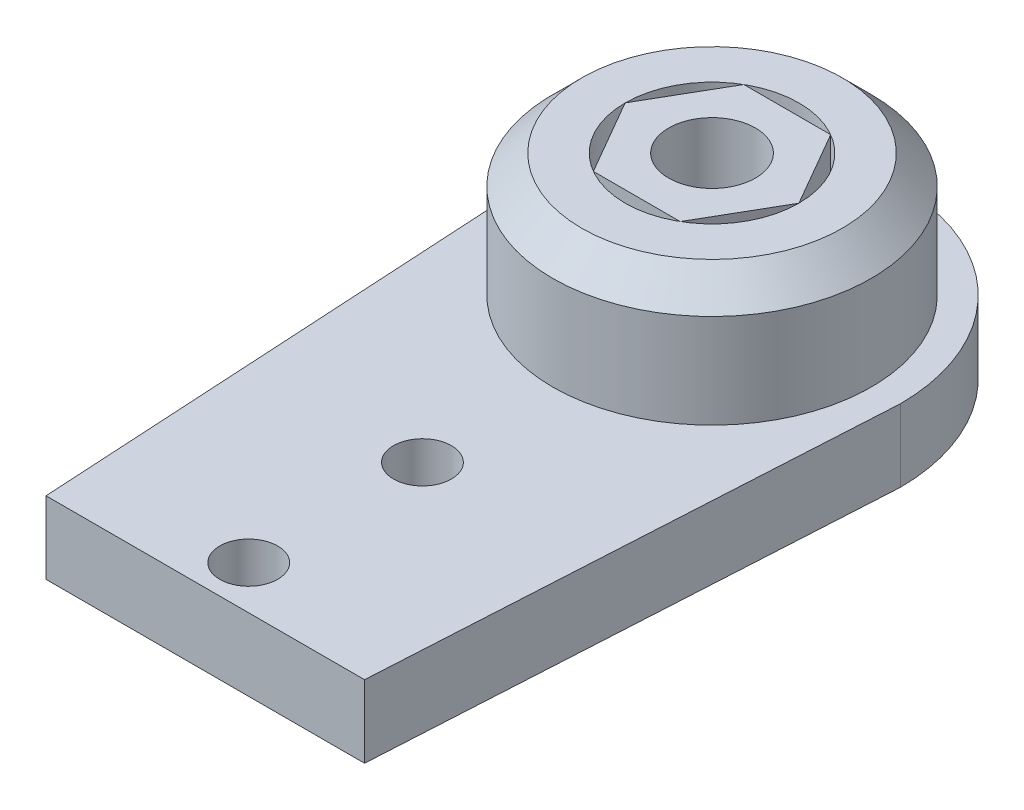
ISO-10303-21;
HEADER;
FILE_DESCRIPTION(('STEP AP214'),'2;1');
FILE_NAME('part.step','',(''),(''),'','','');
FILE_SCHEMA(('AUTOMOTIVE_DESIGN { 1 0 10303 214 1 1 1 1 }'));
ENDSEC;
DATA;
#1=APPLICATION_CONTEXT('core data for automotive mechanical design processes');
#2=APPLICATION_PROTOCOL_DEFINITION('international standard','automotive_design',2000,#1);
#3=PRODUCT_CONTEXT('',#1,'mechanical');
#4=PRODUCT('Part','Part','',(#3));
#5=PRODUCT_RELATED_PRODUCT_CATEGORY('part','',(#4));
#6=PRODUCT_DEFINITION_FORMATION('','',#4);
#7=PRODUCT_DEFINITION_CONTEXT('part definition',#1,'design');
#8=PRODUCT_DEFINITION('design','',#6,#7);
#9=PRODUCT_DEFINITION_SHAPE('','',#8);
#10=(LENGTH_UNIT() NAMED_UNIT(*) SI_UNIT(.MILLI.,.METRE.));
#11=(NAMED_UNIT(*) PLANE_ANGLE_UNIT() SI_UNIT($,.RADIAN.));
#12=(NAMED_UNIT(*) SI_UNIT($,.STERADIAN.) SOLID_ANGLE_UNIT());
#13=UNCERTAINTY_MEASURE_WITH_UNIT(LENGTH_MEASURE(1.E-05),#10,'distance_accuracy_value','');
#14=(GEOMETRIC_REPRESENTATION_CONTEXT(3) GLOBAL_UNCERTAINTY_ASSIGNED_CONTEXT((#13)) GLOBAL_UNIT_ASSIGNED_CONTEXT((#10,
#11,#12)) REPRESENTATION_CONTEXT('',''));
#15=CARTESIAN_POINT('',(0.,0.,0.));
#16=DIRECTION('',(0.,0.,1.));
#17=DIRECTION('',(1.,0.,0.));
#18=AXIS2_PLACEMENT_3D('',#15,#16,#17);
#19=CARTESIAN_POINT('',(1.50000000000003,4.25,2.5980762113533));
#20=DIRECTION('',(0.866025403784442,0.,0.499999999999995));
#21=DIRECTION('',(0.499999999999995,0.,-0.866025403784442));
#22=AXIS2_PLACEMENT_3D('',#19,#20,#21);
#23=PLANE('',#22);
#24=DIRECTION('',(0.499999999999995,0.,-0.866025403784441));
#25=VECTOR('',#24,1.);
#26=CARTESIAN_POINT('',(1.50000000000003,6.75,2.5980762113533));
#27=LINE('',#26,#25);
#28=CARTESIAN_POINT('',(1.50000000000003,6.75,2.5980762113533));
#29=VERTEX_POINT('',#28);
#30=CARTESIAN_POINT('',(3.,6.75,0.));
#31=VERTEX_POINT('',#30);
#32=EDGE_CURVE('E129',#29,#31,#27,.T.);
#33=ORIENTED_EDGE('',*,*,#32,.F.);
#34=DIRECTION('',(0.,1.,0.));
#35=VECTOR('',#34,1.);
#36=CARTESIAN_POINT('',(1.50000000000003,4.25,2.5980762113533));
#37=LINE('',#36,#35);
#38=CARTESIAN_POINT('',(1.50000000000003,4.25,2.5980762113533));
#39=VERTEX_POINT('',#38);
#40=EDGE_CURVE('E12',#39,#29,#37,.T.);
#41=ORIENTED_EDGE('',*,*,#40,.F.);
#42=DIRECTION('',(0.499999999999995,0.,-0.866025403784441));
#43=VECTOR('',#42,1.);
#44=CARTESIAN_POINT('',(1.50000000000003,4.25,2.5980762113533));
#45=LINE('',#44,#43);
#46=CARTESIAN_POINT('',(3.,4.25,0.));
#47=VERTEX_POINT('',#46);
#48=EDGE_CURVE('E144',#39,#47,#45,.T.);
#49=ORIENTED_EDGE('',*,*,#48,.T.);
#50=DIRECTION('',(0.,1.,0.));
#51=VECTOR('',#50,1.);
#52=CARTESIAN_POINT('',(3.,4.25,0.));
#53=LINE('',#52,#51);
#54=EDGE_CURVE('E47',#47,#31,#53,.T.);
#55=ORIENTED_EDGE('',*,*,#54,.T.);
#56=EDGE_LOOP('',(#33,#41,#49,#55));
#57=FACE_BOUND('',#56,.T.);
#58=ADVANCED_FACE('F44',(#57),#23,.T.);
#59=CARTESIAN_POINT('',(-1.49999999999998,4.25,2.59807621135333));
#60=DIRECTION('',(0.,0.,1.));
#61=DIRECTION('',(1.,0.,0.));
#62=AXIS2_PLACEMENT_3D('',#59,#60,#61);
#63=PLANE('',#62);
#64=DIRECTION('',(1.,0.,0.));
#65=VECTOR('',#64,1.);
#66=CARTESIAN_POINT('',(-1.49999999999998,6.75,2.59807621135333));
#67=LINE('',#66,#65);
#68=CARTESIAN_POINT('',(-1.49999999999998,6.75,2.59807621135333));
#69=VERTEX_POINT('',#68);
#70=EDGE_CURVE('E142',#69,#29,#67,.T.);
#71=ORIENTED_EDGE('',*,*,#70,.F.);
#72=DIRECTION('',(0.,1.,0.));
#73=VECTOR('',#72,1.);
#74=CARTESIAN_POINT('',(-1.49999999999998,4.25,2.59807621135333));
#75=LINE('',#74,#73);
#76=CARTESIAN_POINT('',(-1.49999999999998,4.25,2.59807621135333));
#77=VERTEX_POINT('',#76);
#78=EDGE_CURVE('E53',#77,#69,#75,.T.);
#79=ORIENTED_EDGE('',*,*,#78,.F.);
#80=DIRECTION('',(1.,0.,0.));
#81=VECTOR('',#80,1.);
#82=CARTESIAN_POINT('',(-1.49999999999998,4.25,2.59807621135333));
#83=LINE('',#82,#81);
#84=EDGE_CURVE('E119',#77,#39,#83,.T.);
#85=ORIENTED_EDGE('',*,*,#84,.T.);
#86=ORIENTED_EDGE('',*,*,#40,.T.);
#87=EDGE_LOOP('',(#71,#79,#85,#86));
#88=FACE_BOUND('',#87,.T.);
#89=ADVANCED_FACE('F152',(#88),#63,.T.);
#90=CARTESIAN_POINT('',(-3.,4.25,0.));
#91=DIRECTION('',(-0.866025403784435,0.,0.500000000000007));
#92=DIRECTION('',(0.500000000000007,0.,0.866025403784435));
#93=AXIS2_PLACEMENT_3D('',#90,#91,#92);
#94=PLANE('',#93);
#95=DIRECTION('',(0.500000000000007,0.,0.866025403784434));
#96=VECTOR('',#95,1.);
#97=CARTESIAN_POINT('',(-3.,6.75,0.));
#98=LINE('',#97,#96);
#99=CARTESIAN_POINT('',(-3.,6.75,0.));
#100=VERTEX_POINT('',#99);
#101=EDGE_CURVE('E106',#100,#69,#98,.T.);
#102=ORIENTED_EDGE('',*,*,#101,.F.);
#103=DIRECTION('',(0.,1.,0.));
#104=VECTOR('',#103,1.);
#105=CARTESIAN_POINT('',(-3.,4.25,0.));
#106=LINE('',#105,#104);
#107=CARTESIAN_POINT('',(-3.,4.25,0.));
#108=VERTEX_POINT('',#107);
#109=EDGE_CURVE('E101',#108,#100,#106,.T.);
#110=ORIENTED_EDGE('',*,*,#109,.F.);
#111=DIRECTION('',(0.500000000000007,0.,0.866025403784434));
#112=VECTOR('',#111,1.);
#113=CARTESIAN_POINT('',(-3.,4.25,0.));
#114=LINE('',#113,#112);
#115=EDGE_CURVE('E104',#108,#77,#114,.T.);
#116=ORIENTED_EDGE('',*,*,#115,.T.);
#117=ORIENTED_EDGE('',*,*,#78,.T.);
#118=EDGE_LOOP('',(#102,#110,#116,#117));
#119=FACE_BOUND('',#118,.T.);
#120=ADVANCED_FACE('F103',(#119),#94,.T.);
#121=CARTESIAN_POINT('',(-1.50000000000001,4.25,-2.59807621135331));
#122=DIRECTION('',(-0.866025403784442,0.,-0.499999999999995));
#123=DIRECTION('',(-0.499999999999995,0.,0.866025403784442));
#124=AXIS2_PLACEMENT_3D('',#121,#122,#123);
#125=PLANE('',#124);
#126=DIRECTION('',(-0.499999999999995,0.,0.866025403784441));
#127=VECTOR('',#126,1.);
#128=CARTESIAN_POINT('',(-1.50000000000001,6.75,-2.59807621135331));
#129=LINE('',#128,#127);
#130=CARTESIAN_POINT('',(-1.50000000000001,6.75,-2.59807621135331));
#131=VERTEX_POINT('',#130);
#132=EDGE_CURVE('E139',#131,#100,#129,.T.);
#133=ORIENTED_EDGE('',*,*,#132,.F.);
#134=DIRECTION('',(0.,1.,0.));
#135=VECTOR('',#134,1.);
#136=CARTESIAN_POINT('',(-1.50000000000001,4.25,-2.59807621135331));
#137=LINE('',#136,#135);
#138=CARTESIAN_POINT('',(-1.50000000000001,4.25,-2.59807621135331));
#139=VERTEX_POINT('',#138);
#140=EDGE_CURVE('E111',#139,#131,#137,.T.);
#141=ORIENTED_EDGE('',*,*,#140,.F.);
#142=DIRECTION('',(-0.499999999999995,0.,0.866025403784441));
#143=VECTOR('',#142,1.);
#144=CARTESIAN_POINT('',(-1.50000000000001,4.25,-2.59807621135331));
#145=LINE('',#144,#143);
#146=EDGE_CURVE('E117',#139,#108,#145,.T.);
#147=ORIENTED_EDGE('',*,*,#146,.T.);
#148=ORIENTED_EDGE('',*,*,#109,.T.);
#149=EDGE_LOOP('',(#133,#141,#147,#148));
#150=FACE_BOUND('',#149,.T.);
#151=ADVANCED_FACE('F121',(#150),#125,.T.);
#152=CARTESIAN_POINT('',(1.49999999999999,4.25,-2.59807621135332));
#153=DIRECTION('',(0.,0.,-1.));
#154=DIRECTION('',(-1.,0.,0.));
#155=AXIS2_PLACEMENT_3D('',#152,#153,#154);
#156=PLANE('',#155);
#157=DIRECTION('',(-1.,0.,0.));
#158=VECTOR('',#157,1.);
#159=CARTESIAN_POINT('',(1.49999999999999,6.75,-2.59807621135332));
#160=LINE('',#159,#158);
#161=CARTESIAN_POINT('',(1.49999999999999,6.75,-2.59807621135332));
#162=VERTEX_POINT('',#161);
#163=EDGE_CURVE('E136',#162,#131,#160,.T.);
#164=ORIENTED_EDGE('',*,*,#163,.F.);
#165=DIRECTION('',(0.,1.,0.));
#166=VECTOR('',#165,1.);
#167=CARTESIAN_POINT('',(1.49999999999999,4.25,-2.59807621135332));
#168=LINE('',#167,#166);
#169=CARTESIAN_POINT('',(1.49999999999999,4.25,-2.59807621135332));
#170=VERTEX_POINT('',#169);
#171=EDGE_CURVE('E147',#170,#162,#168,.T.);
#172=ORIENTED_EDGE('',*,*,#171,.F.);
#173=DIRECTION('',(-1.,0.,0.));
#174=VECTOR('',#173,1.);
#175=CARTESIAN_POINT('',(1.49999999999999,4.25,-2.59807621135332));
#176=LINE('',#175,#174);
#177=EDGE_CURVE('E122',#170,#139,#176,.T.);
#178=ORIENTED_EDGE('',*,*,#177,.T.);
#179=ORIENTED_EDGE('',*,*,#140,.T.);
#180=EDGE_LOOP('',(#164,#172,#178,#179));
#181=FACE_BOUND('',#180,.T.);
#182=ADVANCED_FACE('F165',(#181),#156,.T.);
#183=CARTESIAN_POINT('',(3.,4.25,0.));
#184=DIRECTION('',(0.866025403784438,0.,-0.500000000000001));
#185=DIRECTION('',(-0.500000000000001,0.,-0.866025403784438));
#186=AXIS2_PLACEMENT_3D('',#183,#184,#185);
#187=PLANE('',#186);
#188=DIRECTION('',(-0.500000000000001,0.,-0.866025403784438));
#189=VECTOR('',#188,1.);
#190=CARTESIAN_POINT('',(3.,6.75,0.));
#191=LINE('',#190,#189);
#192=EDGE_CURVE('E132',#31,#162,#191,.T.);
#193=ORIENTED_EDGE('',*,*,#192,.F.);
#194=ORIENTED_EDGE('',*,*,#54,.F.);
#195=DIRECTION('',(-0.500000000000001,0.,-0.866025403784438));
#196=VECTOR('',#195,1.);
#197=CARTESIAN_POINT('',(3.,4.25,0.));
#198=LINE('',#197,#196);
#199=EDGE_CURVE('E124',#47,#170,#198,.T.);
#200=ORIENTED_EDGE('',*,*,#199,.T.);
#201=ORIENTED_EDGE('',*,*,#171,.T.);
#202=EDGE_LOOP('',(#193,#194,#200,#201));
#203=FACE_BOUND('',#202,.T.);
#204=ADVANCED_FACE('F149',(#203),#187,.T.);
#205=CARTESIAN_POINT('',(0.,4.25,0.));
#206=DIRECTION('',(0.,1.,0.));
#207=DIRECTION('',(0.,0.,1.));
#208=AXIS2_PLACEMENT_3D('',#205,#206,#207);
#209=PLANE('',#208);
#210=CARTESIAN_POINT('',(0.,4.25,0.));
#211=DIRECTION('',(0.,1.,0.));
#212=DIRECTION('',(0.,0.,1.));
#213=AXIS2_PLACEMENT_3D('',#210,#211,#212);
#214=CIRCLE('',#213,1.5);
#215=CARTESIAN_POINT('',(0.,4.25,1.5));
#216=VERTEX_POINT('',#215);
#217=EDGE_CURVE('E133',#216,#216,#214,.T.);
#218=ORIENTED_EDGE('',*,*,#217,.T.);
#219=EDGE_LOOP('',(#218));
#220=FACE_BOUND('',#219,.T.);
#221=ORIENTED_EDGE('',*,*,#48,.F.);
#222=ORIENTED_EDGE('',*,*,#84,.F.);
#223=ORIENTED_EDGE('',*,*,#115,.F.);
#224=ORIENTED_EDGE('',*,*,#146,.F.);
#225=ORIENTED_EDGE('',*,*,#177,.F.);
#226=ORIENTED_EDGE('',*,*,#199,.F.);
#227=EDGE_LOOP('',(#221,#222,#223,#224,#225,#226));
#228=FACE_BOUND('',#227,.T.);
#229=ADVANCED_FACE('F115',(#220,#228),#209,.F.);
#230=CARTESIAN_POINT('',(0.,6.75,0.));
#231=DIRECTION('',(0.,1.,0.));
#232=DIRECTION('',(0.,0.,1.));
#233=AXIS2_PLACEMENT_3D('',#230,#231,#232);
#234=PLANE('',#233);
#235=CARTESIAN_POINT('',(0.,6.75,0.));
#236=DIRECTION('',(0.,1.,0.));
#237=DIRECTION('',(0.,0.,1.));
#238=AXIS2_PLACEMENT_3D('',#235,#236,#237);
#239=CIRCLE('',#238,1.5);
#240=CARTESIAN_POINT('',(0.,6.75,1.5));
#241=VERTEX_POINT('',#240);
#242=EDGE_CURVE('E188',#241,#241,#239,.T.);
#243=ORIENTED_EDGE('',*,*,#242,.F.);
#244=EDGE_LOOP('',(#243));
#245=FACE_BOUND('',#244,.T.);
#246=ORIENTED_EDGE('',*,*,#32,.T.);
#247=ORIENTED_EDGE('',*,*,#192,.T.);
#248=ORIENTED_EDGE('',*,*,#163,.T.);
#249=ORIENTED_EDGE('',*,*,#132,.T.);
#250=ORIENTED_EDGE('',*,*,#101,.T.);
#251=ORIENTED_EDGE('',*,*,#70,.T.);
#252=EDGE_LOOP('',(#246,#247,#248,#249,#250,#251));
#253=FACE_BOUND('',#252,.T.);
#254=ADVANCED_FACE('F151',(#245,#253),#234,.T.);
#255=CARTESIAN_POINT('',(0.,4.25,0.));
#256=DIRECTION('',(0.,1.,0.));
#257=DIRECTION('',(0.,0.,1.));
#258=AXIS2_PLACEMENT_3D('',#255,#256,#257);
#259=CYLINDRICAL_SURFACE('',#258,1.5);
#260=ORIENTED_EDGE('',*,*,#217,.F.);
#261=EDGE_LOOP('',(#260));
#262=FACE_BOUND('',#261,.T.);
#263=ORIENTED_EDGE('',*,*,#242,.T.);
#264=EDGE_LOOP('',(#263));
#265=FACE_BOUND('',#264,.T.);
#266=ADVANCED_FACE('F176',(#262,#265),#259,.F.);
#267=CLOSED_SHELL('',(#58,#89,#120,#151,#182,#204,#229,#254,#266));
#268=MANIFOLD_SOLID_BREP('B2',#267);
#269=CARTESIAN_POINT('',(0.,2.5,0.));
#270=DIRECTION('',(0.,1.,0.));
#271=DIRECTION('',(0.,0.,1.));
#272=AXIS2_PLACEMENT_3D('',#269,#270,#271);
#273=PLANE('',#272);
#274=CARTESIAN_POINT('',(0.,2.5,16.));
#275=DIRECTION('',(0.,1.,0.));
#276=DIRECTION('',(0.,0.,1.));
#277=AXIS2_PLACEMENT_3D('',#274,#275,#276);
#278=CIRCLE('',#277,1.);
#279=CARTESIAN_POINT('',(0.,2.5,17.));
#280=VERTEX_POINT('',#279);
#281=EDGE_CURVE('E321',#280,#280,#278,.T.);
#282=ORIENTED_EDGE('',*,*,#281,.F.);
#283=EDGE_LOOP('',(#282));
#284=FACE_BOUND('',#283,.T.);
#285=CARTESIAN_POINT('',(0.,2.5,10.));
#286=DIRECTION('',(0.,1.,0.));
#287=DIRECTION('',(0.,0.,1.));
#288=AXIS2_PLACEMENT_3D('',#285,#286,#287);
#289=CIRCLE('',#288,1.);
#290=CARTESIAN_POINT('',(0.,2.5,11.));
#291=VERTEX_POINT('',#290);
#292=EDGE_CURVE('E381',#291,#291,#289,.T.);
#293=ORIENTED_EDGE('',*,*,#292,.F.);
#294=EDGE_LOOP('',(#293));
#295=FACE_BOUND('',#294,.T.);
#296=DIRECTION('',(0.0570497905385129,0.,-0.998371334423977));
#297=VECTOR('',#296,1.);
#298=CARTESIAN_POINT('',(6.47884458909683,2.5,0.370219690805533));
#299=LINE('',#298,#297);
#300=CARTESIAN_POINT('',(5.5,2.5,17.5));
#301=VERTEX_POINT('',#300);
#302=CARTESIAN_POINT('',(6.5,2.5,0.));
#303=VERTEX_POINT('',#302);
#304=EDGE_CURVE('E293',#301,#303,#299,.T.);
#305=ORIENTED_EDGE('',*,*,#304,.T.);
#306=CARTESIAN_POINT('',(0.,2.5,0.));
#307=DIRECTION('',(0.,1.,0.));
#308=DIRECTION('',(0.,0.,1.));
#309=AXIS2_PLACEMENT_3D('',#306,#307,#308);
#310=CIRCLE('',#309,6.5);
#311=CARTESIAN_POINT('',(-6.5,2.5,0.));
#312=VERTEX_POINT('',#311);
#313=EDGE_CURVE('E288',#303,#312,#310,.T.);
#314=ORIENTED_EDGE('',*,*,#313,.T.);
#315=DIRECTION('',(0.0570497905385129,0.,0.998371334423977));
#316=VECTOR('',#315,1.);
#317=CARTESIAN_POINT('',(-6.47884458909683,2.5,0.370219690805533));
#318=LINE('',#317,#316);
#319=CARTESIAN_POINT('',(-5.5,2.5,17.5));
#320=VERTEX_POINT('',#319);
#321=EDGE_CURVE('E291',#312,#320,#318,.T.);
#322=ORIENTED_EDGE('',*,*,#321,.T.);
#323=DIRECTION('',(1.,0.,0.));
#324=VECTOR('',#323,1.);
#325=CARTESIAN_POINT('',(0.,2.5,17.5));
#326=LINE('',#325,#324);
#327=EDGE_CURVE('E257',#320,#301,#326,.T.);
#328=ORIENTED_EDGE('',*,*,#327,.T.);
#329=EDGE_LOOP('',(#305,#314,#322,#328));
#330=FACE_BOUND('',#329,.T.);
#331=CARTESIAN_POINT('',(0.,2.5,0.));
#332=DIRECTION('',(0.,1.,0.));
#333=DIRECTION('',(0.,0.,1.));
#334=AXIS2_PLACEMENT_3D('',#331,#332,#333);
#335=CIRCLE('',#334,5.5);
#336=CARTESIAN_POINT('',(0.,2.5,5.5));
#337=VERTEX_POINT('',#336);
#338=EDGE_CURVE('E312',#337,#337,#335,.T.);
#339=ORIENTED_EDGE('',*,*,#338,.F.);
#340=EDGE_LOOP('',(#339));
#341=FACE_BOUND('',#340,.T.);
#342=ADVANCED_FACE('F240',(#284,#295,#330,#341),#273,.T.);
#343=CARTESIAN_POINT('',(6.47884458909683,2.5,0.370219690805533));
#344=DIRECTION('',(-0.998371334423977,0.,-0.057049790538513));
#345=DIRECTION('',(-0.057049790538513,0.,0.998371334423977));
#346=AXIS2_PLACEMENT_3D('',#343,#344,#345);
#347=PLANE('',#346);
#348=DIRECTION('',(0.0570497905385129,0.,-0.998371334423977));
#349=VECTOR('',#348,1.);
#350=CARTESIAN_POINT('',(6.47884458909683,0.,0.370219690805533));
#351=LINE('',#350,#349);
#352=CARTESIAN_POINT('',(5.5,0.,17.5));
#353=VERTEX_POINT('',#352);
#354=CARTESIAN_POINT('',(6.5,0.,0.));
#355=VERTEX_POINT('',#354);
#356=EDGE_CURVE('E315',#353,#355,#351,.T.);
#357=ORIENTED_EDGE('',*,*,#356,.T.);
#358=DIRECTION('',(0.,-1.,0.));
#359=VECTOR('',#358,1.);
#360=CARTESIAN_POINT('',(6.5,2.5,0.));
#361=LINE('',#360,#359);
#362=EDGE_CURVE('E299',#303,#355,#361,.T.);
#363=ORIENTED_EDGE('',*,*,#362,.F.);
#364=ORIENTED_EDGE('',*,*,#304,.F.);
#365=DIRECTION('',(0.,-1.,0.));
#366=VECTOR('',#365,1.);
#367=CARTESIAN_POINT('',(5.5,2.5,17.5));
#368=LINE('',#367,#366);
#369=EDGE_CURVE('E304',#301,#353,#368,.T.);
#370=ORIENTED_EDGE('',*,*,#369,.T.);
#371=EDGE_LOOP('',(#357,#363,#364,#370));
#372=FACE_BOUND('',#371,.T.);
#373=ADVANCED_FACE('F341',(#372),#347,.F.);
#374=CARTESIAN_POINT('',(0.,2.5,0.));
#375=DIRECTION('',(0.,-1.,0.));
#376=DIRECTION('',(0.,0.,-1.));
#377=AXIS2_PLACEMENT_3D('',#374,#375,#376);
#378=CYLINDRICAL_SURFACE('',#377,6.5);
#379=CARTESIAN_POINT('',(0.,0.,0.));
#380=DIRECTION('',(0.,1.,0.));
#381=DIRECTION('',(0.,0.,1.));
#382=AXIS2_PLACEMENT_3D('',#379,#380,#381);
#383=CIRCLE('',#382,6.5);
#384=CARTESIAN_POINT('',(-6.5,0.,0.));
#385=VERTEX_POINT('',#384);
#386=EDGE_CURVE('E298',#355,#385,#383,.T.);
#387=ORIENTED_EDGE('',*,*,#386,.T.);
#388=DIRECTION('',(0.,-1.,0.));
#389=VECTOR('',#388,1.);
#390=CARTESIAN_POINT('',(-6.5,2.5,0.));
#391=LINE('',#390,#389);
#392=EDGE_CURVE('E296',#312,#385,#391,.T.);
#393=ORIENTED_EDGE('',*,*,#392,.F.);
#394=ORIENTED_EDGE('',*,*,#313,.F.);
#395=ORIENTED_EDGE('',*,*,#362,.T.);
#396=EDGE_LOOP('',(#387,#393,#394,#395));
#397=FACE_BOUND('',#396,.T.);
#398=ADVANCED_FACE('F297',(#397),#378,.T.);
#399=CARTESIAN_POINT('',(-6.47884458909683,2.5,0.370219690805533));
#400=DIRECTION('',(0.998371334423977,0.,-0.057049790538513));
#401=DIRECTION('',(-0.057049790538513,0.,-0.998371334423977));
#402=AXIS2_PLACEMENT_3D('',#399,#400,#401);
#403=PLANE('',#402);
#404=DIRECTION('',(0.0570497905385129,0.,0.998371334423977));
#405=VECTOR('',#404,1.);
#406=CARTESIAN_POINT('',(-6.47884458909683,0.,0.370219690805533));
#407=LINE('',#406,#405);
#408=CARTESIAN_POINT('',(-5.5,0.,17.5));
#409=VERTEX_POINT('',#408);
#410=EDGE_CURVE('E274',#385,#409,#407,.T.);
#411=ORIENTED_EDGE('',*,*,#410,.T.);
#412=DIRECTION('',(0.,-1.,0.));
#413=VECTOR('',#412,1.);
#414=CARTESIAN_POINT('',(-5.5,2.5,17.5));
#415=LINE('',#414,#413);
#416=EDGE_CURVE('E300',#320,#409,#415,.T.);
#417=ORIENTED_EDGE('',*,*,#416,.F.);
#418=ORIENTED_EDGE('',*,*,#321,.F.);
#419=ORIENTED_EDGE('',*,*,#392,.T.);
#420=EDGE_LOOP('',(#411,#417,#418,#419));
#421=FACE_BOUND('',#420,.T.);
#422=ADVANCED_FACE('F302',(#421),#403,.F.);
#423=CARTESIAN_POINT('',(0.,2.5,10.));
#424=DIRECTION('',(0.,-1.,0.));
#425=DIRECTION('',(0.,0.,-1.));
#426=AXIS2_PLACEMENT_3D('',#423,#424,#425);
#427=CYLINDRICAL_SURFACE('',#426,1.);
#428=ORIENTED_EDGE('',*,*,#292,.T.);
#429=EDGE_LOOP('',(#428));
#430=FACE_BOUND('',#429,.T.);
#431=CARTESIAN_POINT('',(0.,0.,10.));
#432=DIRECTION('',(0.,1.,0.));
#433=DIRECTION('',(0.,0.,1.));
#434=AXIS2_PLACEMENT_3D('',#431,#432,#433);
#435=CIRCLE('',#434,1.);
#436=CARTESIAN_POINT('',(0.,0.,11.));
#437=VERTEX_POINT('',#436);
#438=EDGE_CURVE('E311',#437,#437,#435,.T.);
#439=ORIENTED_EDGE('',*,*,#438,.F.);
#440=EDGE_LOOP('',(#439));
#441=FACE_BOUND('',#440,.T.);
#442=ADVANCED_FACE('F364',(#430,#441),#427,.F.);
#443=CARTESIAN_POINT('',(0.,2.5,16.));
#444=DIRECTION('',(0.,-1.,0.));
#445=DIRECTION('',(0.,0.,-1.));
#446=AXIS2_PLACEMENT_3D('',#443,#444,#445);
#447=CYLINDRICAL_SURFACE('',#446,1.);
#448=ORIENTED_EDGE('',*,*,#281,.T.);
#449=EDGE_LOOP('',(#448));
#450=FACE_BOUND('',#449,.T.);
#451=CARTESIAN_POINT('',(0.,0.,16.));
#452=DIRECTION('',(0.,1.,0.));
#453=DIRECTION('',(0.,0.,1.));
#454=AXIS2_PLACEMENT_3D('',#451,#452,#453);
#455=CIRCLE('',#454,1.);
#456=CARTESIAN_POINT('',(0.,0.,17.));
#457=VERTEX_POINT('',#456);
#458=EDGE_CURVE('E308',#457,#457,#455,.T.);
#459=ORIENTED_EDGE('',*,*,#458,.F.);
#460=EDGE_LOOP('',(#459));
#461=FACE_BOUND('',#460,.T.);
#462=ADVANCED_FACE('F361',(#450,#461),#447,.F.);
#463=CARTESIAN_POINT('',(0.,2.5,17.5));
#464=DIRECTION('',(0.,0.,-1.));
#465=DIRECTION('',(-1.,0.,0.));
#466=AXIS2_PLACEMENT_3D('',#463,#464,#465);
#467=PLANE('',#466);
#468=DIRECTION('',(1.,0.,0.));
#469=VECTOR('',#468,1.);
#470=CARTESIAN_POINT('',(0.,0.,17.5));
#471=LINE('',#470,#469);
#472=EDGE_CURVE('E280',#409,#353,#471,.T.);
#473=ORIENTED_EDGE('',*,*,#472,.T.);
#474=ORIENTED_EDGE('',*,*,#369,.F.);
#475=ORIENTED_EDGE('',*,*,#327,.F.);
#476=ORIENTED_EDGE('',*,*,#416,.T.);
#477=EDGE_LOOP('',(#473,#474,#475,#476));
#478=FACE_BOUND('',#477,.T.);
#479=ADVANCED_FACE('F357',(#478),#467,.F.);
#480=CARTESIAN_POINT('',(0.,0.,0.));
#481=DIRECTION('',(0.,1.,0.));
#482=DIRECTION('',(0.,0.,1.));
#483=AXIS2_PLACEMENT_3D('',#480,#481,#482);
#484=PLANE('',#483);
#485=CARTESIAN_POINT('',(0.,0.,0.));
#486=DIRECTION('',(0.,1.,0.));
#487=DIRECTION('',(0.,0.,1.));
#488=AXIS2_PLACEMENT_3D('',#485,#486,#487);
#489=CIRCLE('',#488,3.);
#490=CARTESIAN_POINT('',(0.,0.,3.));
#491=VERTEX_POINT('',#490);
#492=EDGE_CURVE('E391',#491,#491,#489,.F.);
#493=ORIENTED_EDGE('',*,*,#492,.F.);
#494=EDGE_LOOP('',(#493));
#495=FACE_BOUND('',#494,.T.);
#496=ORIENTED_EDGE('',*,*,#458,.T.);
#497=EDGE_LOOP('',(#496));
#498=FACE_BOUND('',#497,.T.);
#499=ORIENTED_EDGE('',*,*,#438,.T.);
#500=EDGE_LOOP('',(#499));
#501=FACE_BOUND('',#500,.T.);
#502=ORIENTED_EDGE('',*,*,#356,.F.);
#503=ORIENTED_EDGE('',*,*,#472,.F.);
#504=ORIENTED_EDGE('',*,*,#410,.F.);
#505=ORIENTED_EDGE('',*,*,#386,.F.);
#506=EDGE_LOOP('',(#502,#503,#504,#505));
#507=FACE_BOUND('',#506,.T.);
#508=ADVANCED_FACE('F354',(#495,#498,#501,#507),#484,.F.);
#509=CARTESIAN_POINT('',(0.,6.75,0.));
#510=DIRECTION('',(0.,1.,0.));
#511=DIRECTION('',(0.,0.,1.));
#512=AXIS2_PLACEMENT_3D('',#509,#510,#511);
#513=PLANE('',#512);
#514=CARTESIAN_POINT('',(0.,6.75,0.));
#515=DIRECTION('',(0.,1.,0.));
#516=DIRECTION('',(0.,0.,1.));
#517=AXIS2_PLACEMENT_3D('',#514,#515,#516);
#518=CIRCLE('',#517,4.5);
#519=CARTESIAN_POINT('',(0.,6.75,4.5));
#520=VERTEX_POINT('',#519);
#521=EDGE_CURVE('E249',#520,#520,#518,.T.);
#522=ORIENTED_EDGE('',*,*,#521,.T.);
#523=EDGE_LOOP('',(#522));
#524=FACE_BOUND('',#523,.T.);
#525=CARTESIAN_POINT('',(0.,6.75,0.));
#526=DIRECTION('',(0.,1.,0.));
#527=DIRECTION('',(0.,0.,1.));
#528=AXIS2_PLACEMENT_3D('',#525,#526,#527);
#529=CIRCLE('',#528,3.);
#530=CARTESIAN_POINT('',(0.,6.75,3.));
#531=VERTEX_POINT('',#530);
#532=EDGE_CURVE('E388',#531,#531,#529,.T.);
#533=ORIENTED_EDGE('',*,*,#532,.F.);
#534=EDGE_LOOP('',(#533));
#535=FACE_BOUND('',#534,.T.);
#536=ADVANCED_FACE('F327',(#524,#535),#513,.T.);
#537=CARTESIAN_POINT('',(0.,6.75,0.));
#538=DIRECTION('',(0.,-1.,0.));
#539=DIRECTION('',(0.,0.,-1.));
#540=AXIS2_PLACEMENT_3D('',#537,#538,#539);
#541=CYLINDRICAL_SURFACE('',#540,5.5);
#542=CARTESIAN_POINT('',(0.,5.75,0.));
#543=DIRECTION('',(0.,1.,0.));
#544=DIRECTION('',(0.,0.,1.));
#545=AXIS2_PLACEMENT_3D('',#542,#543,#544);
#546=CIRCLE('',#545,5.5);
#547=CARTESIAN_POINT('',(0.,5.75,5.5));
#548=VERTEX_POINT('',#547);
#549=EDGE_CURVE('E42',#548,#548,#546,.F.);
#550=ORIENTED_EDGE('',*,*,#549,.T.);
#551=EDGE_LOOP('',(#550));
#552=FACE_BOUND('',#551,.T.);
#553=ORIENTED_EDGE('',*,*,#338,.T.);
#554=EDGE_LOOP('',(#553));
#555=FACE_BOUND('',#554,.T.);
#556=ADVANCED_FACE('F336',(#552,#555),#541,.T.);
#557=CARTESIAN_POINT('',(0.,6.75,0.));
#558=DIRECTION('',(0.,-1.,0.));
#559=DIRECTION('',(0.,0.,-1.));
#560=AXIS2_PLACEMENT_3D('',#557,#558,#559);
#561=CYLINDRICAL_SURFACE('',#560,3.);
#562=ORIENTED_EDGE('',*,*,#532,.T.);
#563=EDGE_LOOP('',(#562));
#564=FACE_BOUND('',#563,.T.);
#565=ORIENTED_EDGE('',*,*,#492,.T.);
#566=EDGE_LOOP('',(#565));
#567=FACE_BOUND('',#566,.T.);
#568=ADVANCED_FACE('F331',(#564,#567),#561,.F.);
#569=CARTESIAN_POINT('',(0.,6.75,0.));
#570=DIRECTION('',(0.,-1.,0.));
#571=DIRECTION('',(0.,0.,-1.));
#572=AXIS2_PLACEMENT_3D('',#569,#570,#571);
#573=CONICAL_SURFACE('',#572,4.5,0.785398163397447);
#574=ORIENTED_EDGE('',*,*,#549,.F.);
#575=EDGE_LOOP('',(#574));
#576=FACE_BOUND('',#575,.T.);
#577=ORIENTED_EDGE('',*,*,#521,.F.);
#578=EDGE_LOOP('',(#577));
#579=FACE_BOUND('',#578,.T.);
#580=ADVANCED_FACE('F242',(#576,#579),#573,.T.);
#581=CLOSED_SHELL('',(#342,#373,#398,#422,#442,#462,#479,#508,#536,#556,#568,#580));
#582=MANIFOLD_SOLID_BREP('B6',#581);
#583=ADVANCED_BREP_SHAPE_REPRESENTATION('',(#18,#268,#582),#14);
#584=SHAPE_DEFINITION_REPRESENTATION(#9,#583);
ENDSEC;
END-ISO-10303-21;
